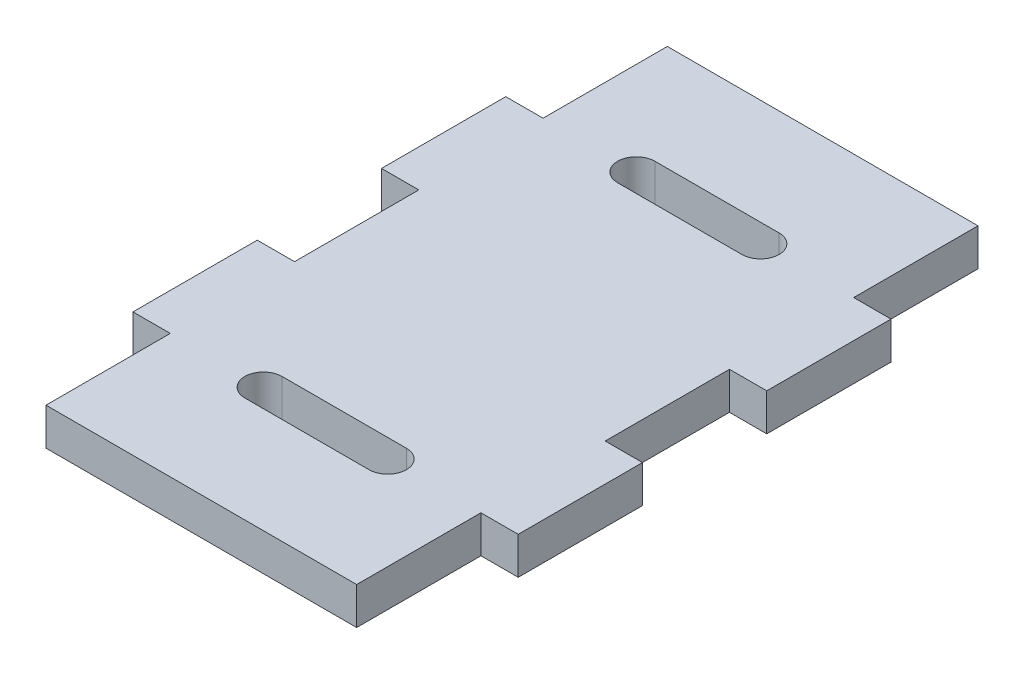
ISO-10303-21;
HEADER;
FILE_DESCRIPTION(('STEP AP214'),'2;1');
FILE_NAME('part.step','',(''),(''),'','','');
FILE_SCHEMA(('AUTOMOTIVE_DESIGN { 1 0 10303 214 1 1 1 1 }'));
ENDSEC;
DATA;
#1=APPLICATION_CONTEXT('core data for automotive mechanical design processes');
#2=APPLICATION_PROTOCOL_DEFINITION('international standard','automotive_design',2000,#1);
#3=PRODUCT_CONTEXT('',#1,'mechanical');
#4=PRODUCT('Part','Part','',(#3));
#5=PRODUCT_RELATED_PRODUCT_CATEGORY('part','',(#4));
#6=PRODUCT_DEFINITION_FORMATION('','',#4);
#7=PRODUCT_DEFINITION_CONTEXT('part definition',#1,'design');
#8=PRODUCT_DEFINITION('design','',#6,#7);
#9=PRODUCT_DEFINITION_SHAPE('','',#8);
#10=(LENGTH_UNIT() NAMED_UNIT(*) SI_UNIT(.MILLI.,.METRE.));
#11=(NAMED_UNIT(*) PLANE_ANGLE_UNIT() SI_UNIT($,.RADIAN.));
#12=(NAMED_UNIT(*) SI_UNIT($,.STERADIAN.) SOLID_ANGLE_UNIT());
#13=UNCERTAINTY_MEASURE_WITH_UNIT(LENGTH_MEASURE(1.E-05),#10,'distance_accuracy_value','');
#14=(GEOMETRIC_REPRESENTATION_CONTEXT(3) GLOBAL_UNCERTAINTY_ASSIGNED_CONTEXT((#13)) GLOBAL_UNIT_ASSIGNED_CONTEXT((#10,
#11,#12)) REPRESENTATION_CONTEXT('',''));
#15=CARTESIAN_POINT('',(0.,0.,0.));
#16=DIRECTION('',(0.,0.,1.));
#17=DIRECTION('',(1.,0.,0.));
#18=AXIS2_PLACEMENT_3D('',#15,#16,#17);
#19=CARTESIAN_POINT('',(-12.5,3.,25.));
#20=DIRECTION('',(1.,0.,0.));
#21=DIRECTION('',(0.,0.,-1.));
#22=AXIS2_PLACEMENT_3D('',#19,#20,#21);
#23=PLANE('',#22);
#24=DIRECTION('',(0.,0.,1.));
#25=VECTOR('',#24,1.);
#26=CARTESIAN_POINT('',(-12.5,0.,25.));
#27=LINE('',#26,#25);
#28=CARTESIAN_POINT('',(-12.5,0.,-25.));
#29=VERTEX_POINT('',#28);
#30=CARTESIAN_POINT('',(-12.5,0.,-15.));
#31=VERTEX_POINT('',#30);
#32=EDGE_CURVE('E280',#29,#31,#27,.T.);
#33=ORIENTED_EDGE('',*,*,#32,.T.);
#34=DIRECTION('',(0.,1.,0.));
#35=VECTOR('',#34,1.);
#36=CARTESIAN_POINT('',(-12.5,-10.4403065089106,-15.));
#37=LINE('',#36,#35);
#38=CARTESIAN_POINT('',(-12.5,3.,-15.));
#39=VERTEX_POINT('',#38);
#40=EDGE_CURVE('E58',#31,#39,#37,.T.);
#41=ORIENTED_EDGE('',*,*,#40,.T.);
#42=DIRECTION('',(0.,0.,1.));
#43=VECTOR('',#42,1.);
#44=CARTESIAN_POINT('',(-12.5,3.,25.));
#45=LINE('',#44,#43);
#46=CARTESIAN_POINT('',(-12.5,3.,-25.));
#47=VERTEX_POINT('',#46);
#48=EDGE_CURVE('E245',#47,#39,#45,.T.);
#49=ORIENTED_EDGE('',*,*,#48,.F.);
#50=DIRECTION('',(0.,-1.,0.));
#51=VECTOR('',#50,1.);
#52=CARTESIAN_POINT('',(-12.5,3.,-25.));
#53=LINE('',#52,#51);
#54=EDGE_CURVE('E321',#47,#29,#53,.T.);
#55=ORIENTED_EDGE('',*,*,#54,.T.);
#56=EDGE_LOOP('',(#33,#41,#49,#55));
#57=FACE_BOUND('',#56,.T.);
#58=ADVANCED_FACE('F33',(#57),#23,.F.);
#59=DIRECTION('',(0.,1.,0.));
#60=VECTOR('',#59,1.);
#61=CARTESIAN_POINT('',(-12.5,-10.4403065089106,15.));
#62=LINE('',#61,#60);
#63=CARTESIAN_POINT('',(-12.5,0.,15.));
#64=VERTEX_POINT('',#63);
#65=CARTESIAN_POINT('',(-12.5,3.,15.));
#66=VERTEX_POINT('',#65);
#67=EDGE_CURVE('E272',#64,#66,#62,.T.);
#68=ORIENTED_EDGE('',*,*,#67,.F.);
#69=CARTESIAN_POINT('',(-12.5,0.,25.));
#70=VERTEX_POINT('',#69);
#71=EDGE_CURVE('E281',#64,#70,#27,.T.);
#72=ORIENTED_EDGE('',*,*,#71,.T.);
#73=DIRECTION('',(0.,-1.,0.));
#74=VECTOR('',#73,1.);
#75=CARTESIAN_POINT('',(-12.5,3.,25.));
#76=LINE('',#75,#74);
#77=CARTESIAN_POINT('',(-12.5,3.,25.));
#78=VERTEX_POINT('',#77);
#79=EDGE_CURVE('E11',#78,#70,#76,.T.);
#80=ORIENTED_EDGE('',*,*,#79,.F.);
#81=EDGE_CURVE('E320',#66,#78,#45,.T.);
#82=ORIENTED_EDGE('',*,*,#81,.F.);
#83=EDGE_LOOP('',(#68,#72,#80,#82));
#84=FACE_BOUND('',#83,.T.);
#85=ADVANCED_FACE('F454',(#84),#23,.F.);
#86=CARTESIAN_POINT('',(12.5,3.,25.));
#87=DIRECTION('',(-1.,0.,0.));
#88=DIRECTION('',(0.,0.,1.));
#89=AXIS2_PLACEMENT_3D('',#86,#87,#88);
#90=PLANE('',#89);
#91=DIRECTION('',(0.,0.,-1.));
#92=VECTOR('',#91,1.);
#93=CARTESIAN_POINT('',(12.5,3.,25.));
#94=LINE('',#93,#92);
#95=CARTESIAN_POINT('',(12.5,3.,5.));
#96=VERTEX_POINT('',#95);
#97=CARTESIAN_POINT('',(12.5,3.,-5.));
#98=VERTEX_POINT('',#97);
#99=EDGE_CURVE('E295',#96,#98,#94,.T.);
#100=ORIENTED_EDGE('',*,*,#99,.F.);
#101=DIRECTION('',(0.,1.,0.));
#102=VECTOR('',#101,1.);
#103=CARTESIAN_POINT('',(12.5,-10.4403065089106,5.));
#104=LINE('',#103,#102);
#105=CARTESIAN_POINT('',(12.5,0.,5.));
#106=VERTEX_POINT('',#105);
#107=EDGE_CURVE('E354',#106,#96,#104,.T.);
#108=ORIENTED_EDGE('',*,*,#107,.F.);
#109=DIRECTION('',(0.,0.,-1.));
#110=VECTOR('',#109,1.);
#111=CARTESIAN_POINT('',(12.5,0.,25.));
#112=LINE('',#111,#110);
#113=CARTESIAN_POINT('',(12.5,0.,-5.));
#114=VERTEX_POINT('',#113);
#115=EDGE_CURVE('E299',#106,#114,#112,.T.);
#116=ORIENTED_EDGE('',*,*,#115,.T.);
#117=DIRECTION('',(0.,1.,0.));
#118=VECTOR('',#117,1.);
#119=CARTESIAN_POINT('',(12.5,-10.4403065089106,-5.));
#120=LINE('',#119,#118);
#121=EDGE_CURVE('E351',#114,#98,#120,.T.);
#122=ORIENTED_EDGE('',*,*,#121,.T.);
#123=EDGE_LOOP('',(#100,#108,#116,#122));
#124=FACE_BOUND('',#123,.T.);
#125=ADVANCED_FACE('F349',(#124),#90,.F.);
#126=DIRECTION('',(0.,1.,0.));
#127=VECTOR('',#126,1.);
#128=CARTESIAN_POINT('',(12.5,-10.4403065089106,-15.));
#129=LINE('',#128,#127);
#130=CARTESIAN_POINT('',(12.5,0.,-15.));
#131=VERTEX_POINT('',#130);
#132=CARTESIAN_POINT('',(12.5,3.,-15.));
#133=VERTEX_POINT('',#132);
#134=EDGE_CURVE('E498',#131,#133,#129,.T.);
#135=ORIENTED_EDGE('',*,*,#134,.F.);
#136=CARTESIAN_POINT('',(12.5,0.,-25.));
#137=VERTEX_POINT('',#136);
#138=EDGE_CURVE('E311',#131,#137,#112,.T.);
#139=ORIENTED_EDGE('',*,*,#138,.T.);
#140=DIRECTION('',(0.,-1.,0.));
#141=VECTOR('',#140,1.);
#142=CARTESIAN_POINT('',(12.5,3.,-25.));
#143=LINE('',#142,#141);
#144=CARTESIAN_POINT('',(12.5,3.,-25.));
#145=VERTEX_POINT('',#144);
#146=EDGE_CURVE('E324',#145,#137,#143,.T.);
#147=ORIENTED_EDGE('',*,*,#146,.F.);
#148=EDGE_CURVE('E298',#133,#145,#94,.T.);
#149=ORIENTED_EDGE('',*,*,#148,.F.);
#150=EDGE_LOOP('',(#135,#139,#147,#149));
#151=FACE_BOUND('',#150,.T.);
#152=ADVANCED_FACE('F556',(#151),#90,.F.);
#153=CARTESIAN_POINT('',(0.,3.,0.));
#154=DIRECTION('',(0.,1.,0.));
#155=DIRECTION('',(0.,0.,1.));
#156=AXIS2_PLACEMENT_3D('',#153,#154,#155);
#157=PLANE('',#156);
#158=ORIENTED_EDGE('',*,*,#48,.T.);
#159=DIRECTION('',(-1.,0.,0.));
#160=VECTOR('',#159,1.);
#161=CARTESIAN_POINT('',(-12.5,3.,-15.));
#162=LINE('',#161,#160);
#163=CARTESIAN_POINT('',(-15.5,3.,-15.));
#164=VERTEX_POINT('',#163);
#165=EDGE_CURVE('E227',#39,#164,#162,.T.);
#166=ORIENTED_EDGE('',*,*,#165,.T.);
#167=DIRECTION('',(0.,0.,1.));
#168=VECTOR('',#167,1.);
#169=CARTESIAN_POINT('',(-15.5,3.,-15.));
#170=LINE('',#169,#168);
#171=CARTESIAN_POINT('',(-15.5,3.,-5.));
#172=VERTEX_POINT('',#171);
#173=EDGE_CURVE('E236',#164,#172,#170,.T.);
#174=ORIENTED_EDGE('',*,*,#173,.T.);
#175=DIRECTION('',(1.,0.,0.));
#176=VECTOR('',#175,1.);
#177=CARTESIAN_POINT('',(-12.5,3.,-5.));
#178=LINE('',#177,#176);
#179=CARTESIAN_POINT('',(-12.5,3.,-5.));
#180=VERTEX_POINT('',#179);
#181=EDGE_CURVE('E233',#172,#180,#178,.T.);
#182=ORIENTED_EDGE('',*,*,#181,.T.);
#183=CARTESIAN_POINT('',(-12.5,3.,5.));
#184=VERTEX_POINT('',#183);
#185=EDGE_CURVE('E37',#180,#184,#45,.T.);
#186=ORIENTED_EDGE('',*,*,#185,.T.);
#187=DIRECTION('',(-1.,0.,0.));
#188=VECTOR('',#187,1.);
#189=CARTESIAN_POINT('',(-12.5,3.,5.));
#190=LINE('',#189,#188);
#191=CARTESIAN_POINT('',(-15.5,3.,5.));
#192=VERTEX_POINT('',#191);
#193=EDGE_CURVE('E258',#184,#192,#190,.T.);
#194=ORIENTED_EDGE('',*,*,#193,.T.);
#195=DIRECTION('',(0.,0.,1.));
#196=VECTOR('',#195,1.);
#197=CARTESIAN_POINT('',(-15.5,3.,5.));
#198=LINE('',#197,#196);
#199=CARTESIAN_POINT('',(-15.5,3.,15.));
#200=VERTEX_POINT('',#199);
#201=EDGE_CURVE('E259',#192,#200,#198,.T.);
#202=ORIENTED_EDGE('',*,*,#201,.T.);
#203=DIRECTION('',(1.,0.,0.));
#204=VECTOR('',#203,1.);
#205=CARTESIAN_POINT('',(-12.5,3.,15.));
#206=LINE('',#205,#204);
#207=EDGE_CURVE('E262',#200,#66,#206,.T.);
#208=ORIENTED_EDGE('',*,*,#207,.T.);
#209=ORIENTED_EDGE('',*,*,#81,.T.);
#210=DIRECTION('',(1.,0.,0.));
#211=VECTOR('',#210,1.);
#212=CARTESIAN_POINT('',(12.5,3.,25.));
#213=LINE('',#212,#211);
#214=CARTESIAN_POINT('',(12.5,3.,25.));
#215=VERTEX_POINT('',#214);
#216=EDGE_CURVE('E303',#78,#215,#213,.T.);
#217=ORIENTED_EDGE('',*,*,#216,.T.);
#218=CARTESIAN_POINT('',(12.5,3.,15.));
#219=VERTEX_POINT('',#218);
#220=EDGE_CURVE('E297',#215,#219,#94,.T.);
#221=ORIENTED_EDGE('',*,*,#220,.T.);
#222=DIRECTION('',(1.,0.,0.));
#223=VECTOR('',#222,1.);
#224=CARTESIAN_POINT('',(12.5,3.,15.));
#225=LINE('',#224,#223);
#226=CARTESIAN_POINT('',(15.5,3.,15.));
#227=VERTEX_POINT('',#226);
#228=EDGE_CURVE('E476',#219,#227,#225,.T.);
#229=ORIENTED_EDGE('',*,*,#228,.T.);
#230=DIRECTION('',(0.,0.,-1.));
#231=VECTOR('',#230,1.);
#232=CARTESIAN_POINT('',(15.5,3.,5.));
#233=LINE('',#232,#231);
#234=CARTESIAN_POINT('',(15.5,3.,5.));
#235=VERTEX_POINT('',#234);
#236=EDGE_CURVE('E483',#227,#235,#233,.T.);
#237=ORIENTED_EDGE('',*,*,#236,.T.);
#238=DIRECTION('',(-1.,0.,0.));
#239=VECTOR('',#238,1.);
#240=CARTESIAN_POINT('',(12.5,3.,5.));
#241=LINE('',#240,#239);
#242=EDGE_CURVE('E486',#235,#96,#241,.T.);
#243=ORIENTED_EDGE('',*,*,#242,.T.);
#244=ORIENTED_EDGE('',*,*,#99,.T.);
#245=DIRECTION('',(1.,0.,0.));
#246=VECTOR('',#245,1.);
#247=CARTESIAN_POINT('',(12.5,3.,-5.));
#248=LINE('',#247,#246);
#249=CARTESIAN_POINT('',(15.5,3.,-5.));
#250=VERTEX_POINT('',#249);
#251=EDGE_CURVE('E367',#98,#250,#248,.T.);
#252=ORIENTED_EDGE('',*,*,#251,.T.);
#253=DIRECTION('',(0.,0.,-1.));
#254=VECTOR('',#253,1.);
#255=CARTESIAN_POINT('',(15.5,3.,-15.));
#256=LINE('',#255,#254);
#257=CARTESIAN_POINT('',(15.5,3.,-15.));
#258=VERTEX_POINT('',#257);
#259=EDGE_CURVE('E374',#250,#258,#256,.T.);
#260=ORIENTED_EDGE('',*,*,#259,.T.);
#261=DIRECTION('',(-1.,0.,0.));
#262=VECTOR('',#261,1.);
#263=CARTESIAN_POINT('',(12.5,3.,-15.));
#264=LINE('',#263,#262);
#265=EDGE_CURVE('E369',#258,#133,#264,.T.);
#266=ORIENTED_EDGE('',*,*,#265,.T.);
#267=ORIENTED_EDGE('',*,*,#148,.T.);
#268=DIRECTION('',(-1.,0.,0.));
#269=VECTOR('',#268,1.);
#270=CARTESIAN_POINT('',(12.5,3.,-25.));
#271=LINE('',#270,#269);
#272=EDGE_CURVE('E285',#145,#47,#271,.T.);
#273=ORIENTED_EDGE('',*,*,#272,.T.);
#274=EDGE_LOOP('',(#158,#166,#174,#182,#186,#194,#202,#208,#209,#217,#221,#229,#237,#243,#244,
#252,#260,#266,#267,#273));
#275=FACE_BOUND('',#274,.T.);
#276=DIRECTION('',(1.,0.,0.));
#277=VECTOR('',#276,1.);
#278=CARTESIAN_POINT('',(-5.,3.,-13.5));
#279=LINE('',#278,#277);
#280=CARTESIAN_POINT('',(-5.,3.,-13.5));
#281=VERTEX_POINT('',#280);
#282=CARTESIAN_POINT('',(5.,3.,-13.5));
#283=VERTEX_POINT('',#282);
#284=EDGE_CURVE('E416',#281,#283,#279,.T.);
#285=ORIENTED_EDGE('',*,*,#284,.F.);
#286=CARTESIAN_POINT('',(-5.,3.,-15.));
#287=DIRECTION('',(0.,1.,0.));
#288=DIRECTION('',(0.,0.,1.));
#289=AXIS2_PLACEMENT_3D('',#286,#287,#288);
#290=CIRCLE('',#289,1.5);
#291=CARTESIAN_POINT('',(-5.,3.,-16.5));
#292=VERTEX_POINT('',#291);
#293=EDGE_CURVE('E414',#292,#281,#290,.T.);
#294=ORIENTED_EDGE('',*,*,#293,.F.);
#295=DIRECTION('',(-1.,0.,0.));
#296=VECTOR('',#295,1.);
#297=CARTESIAN_POINT('',(-5.,3.,-16.5));
#298=LINE('',#297,#296);
#299=CARTESIAN_POINT('',(5.,3.,-16.5));
#300=VERTEX_POINT('',#299);
#301=EDGE_CURVE('E422',#300,#292,#298,.T.);
#302=ORIENTED_EDGE('',*,*,#301,.F.);
#303=CARTESIAN_POINT('',(5.,3.,-15.));
#304=DIRECTION('',(0.,1.,0.));
#305=DIRECTION('',(0.,0.,1.));
#306=AXIS2_PLACEMENT_3D('',#303,#304,#305);
#307=CIRCLE('',#306,1.5);
#308=EDGE_CURVE('E419',#283,#300,#307,.T.);
#309=ORIENTED_EDGE('',*,*,#308,.F.);
#310=EDGE_LOOP('',(#285,#294,#302,#309));
#311=FACE_BOUND('',#310,.T.);
#312=DIRECTION('',(1.,0.,0.));
#313=VECTOR('',#312,1.);
#314=CARTESIAN_POINT('',(-4.99999999999999,3.,16.5));
#315=LINE('',#314,#313);
#316=CARTESIAN_POINT('',(-4.99999999999999,3.,16.5));
#317=VERTEX_POINT('',#316);
#318=CARTESIAN_POINT('',(5.00000000000001,3.,16.5));
#319=VERTEX_POINT('',#318);
#320=EDGE_CURVE('E385',#317,#319,#315,.T.);
#321=ORIENTED_EDGE('',*,*,#320,.F.);
#322=CARTESIAN_POINT('',(-4.99999999999999,3.,15.));
#323=DIRECTION('',(0.,1.,0.));
#324=DIRECTION('',(0.,0.,-1.));
#325=AXIS2_PLACEMENT_3D('',#322,#323,#324);
#326=CIRCLE('',#325,1.5);
#327=CARTESIAN_POINT('',(-4.99999999999999,3.,13.5));
#328=VERTEX_POINT('',#327);
#329=EDGE_CURVE('E383',#328,#317,#326,.T.);
#330=ORIENTED_EDGE('',*,*,#329,.F.);
#331=DIRECTION('',(-1.,0.,0.));
#332=VECTOR('',#331,1.);
#333=CARTESIAN_POINT('',(-4.99999999999999,3.,13.5));
#334=LINE('',#333,#332);
#335=CARTESIAN_POINT('',(5.00000000000001,3.,13.5));
#336=VERTEX_POINT('',#335);
#337=EDGE_CURVE('E391',#336,#328,#334,.T.);
#338=ORIENTED_EDGE('',*,*,#337,.F.);
#339=CARTESIAN_POINT('',(5.00000000000001,3.,15.));
#340=DIRECTION('',(0.,1.,0.));
#341=DIRECTION('',(0.,0.,-1.));
#342=AXIS2_PLACEMENT_3D('',#339,#340,#341);
#343=CIRCLE('',#342,1.5);
#344=EDGE_CURVE('E388',#319,#336,#343,.T.);
#345=ORIENTED_EDGE('',*,*,#344,.F.);
#346=EDGE_LOOP('',(#321,#330,#338,#345));
#347=FACE_BOUND('',#346,.T.);
#348=ADVANCED_FACE('F243',(#275,#311,#347),#157,.T.);
#349=CARTESIAN_POINT('',(0.,0.,0.));
#350=DIRECTION('',(0.,1.,0.));
#351=DIRECTION('',(0.,0.,1.));
#352=AXIS2_PLACEMENT_3D('',#349,#350,#351);
#353=PLANE('',#352);
#354=CARTESIAN_POINT('',(-5.,0.,-15.));
#355=DIRECTION('',(0.,1.,0.));
#356=DIRECTION('',(0.,0.,1.));
#357=AXIS2_PLACEMENT_3D('',#354,#355,#356);
#358=CIRCLE('',#357,1.5);
#359=CARTESIAN_POINT('',(-5.,0.,-16.5));
#360=VERTEX_POINT('',#359);
#361=CARTESIAN_POINT('',(-5.,0.,-13.5));
#362=VERTEX_POINT('',#361);
#363=EDGE_CURVE('E413',#360,#362,#358,.T.);
#364=ORIENTED_EDGE('',*,*,#363,.T.);
#365=DIRECTION('',(1.,0.,0.));
#366=VECTOR('',#365,1.);
#367=CARTESIAN_POINT('',(-5.,0.,-13.5));
#368=LINE('',#367,#366);
#369=CARTESIAN_POINT('',(5.,0.,-13.5));
#370=VERTEX_POINT('',#369);
#371=EDGE_CURVE('E427',#362,#370,#368,.T.);
#372=ORIENTED_EDGE('',*,*,#371,.T.);
#373=CARTESIAN_POINT('',(5.,0.,-15.));
#374=DIRECTION('',(0.,1.,0.));
#375=DIRECTION('',(0.,0.,1.));
#376=AXIS2_PLACEMENT_3D('',#373,#374,#375);
#377=CIRCLE('',#376,1.5);
#378=CARTESIAN_POINT('',(5.,0.,-16.5));
#379=VERTEX_POINT('',#378);
#380=EDGE_CURVE('E430',#370,#379,#377,.T.);
#381=ORIENTED_EDGE('',*,*,#380,.T.);
#382=DIRECTION('',(-1.,0.,0.));
#383=VECTOR('',#382,1.);
#384=CARTESIAN_POINT('',(-5.,0.,-16.5));
#385=LINE('',#384,#383);
#386=EDGE_CURVE('E417',#379,#360,#385,.T.);
#387=ORIENTED_EDGE('',*,*,#386,.T.);
#388=EDGE_LOOP('',(#364,#372,#381,#387));
#389=FACE_BOUND('',#388,.T.);
#390=ORIENTED_EDGE('',*,*,#32,.F.);
#391=DIRECTION('',(-1.,0.,0.));
#392=VECTOR('',#391,1.);
#393=CARTESIAN_POINT('',(12.5,0.,-25.));
#394=LINE('',#393,#392);
#395=EDGE_CURVE('E316',#137,#29,#394,.T.);
#396=ORIENTED_EDGE('',*,*,#395,.F.);
#397=ORIENTED_EDGE('',*,*,#138,.F.);
#398=DIRECTION('',(1.,0.,0.));
#399=VECTOR('',#398,1.);
#400=CARTESIAN_POINT('',(12.5,0.,-15.));
#401=LINE('',#400,#399);
#402=CARTESIAN_POINT('',(15.5,0.,-15.));
#403=VERTEX_POINT('',#402);
#404=EDGE_CURVE('E363',#131,#403,#401,.T.);
#405=ORIENTED_EDGE('',*,*,#404,.T.);
#406=DIRECTION('',(0.,0.,1.));
#407=VECTOR('',#406,1.);
#408=CARTESIAN_POINT('',(15.5,0.,-15.));
#409=LINE('',#408,#407);
#410=CARTESIAN_POINT('',(15.5,0.,-5.));
#411=VERTEX_POINT('',#410);
#412=EDGE_CURVE('E359',#403,#411,#409,.T.);
#413=ORIENTED_EDGE('',*,*,#412,.T.);
#414=DIRECTION('',(-1.,0.,0.));
#415=VECTOR('',#414,1.);
#416=CARTESIAN_POINT('',(12.5,0.,-5.));
#417=LINE('',#416,#415);
#418=EDGE_CURVE('E357',#411,#114,#417,.T.);
#419=ORIENTED_EDGE('',*,*,#418,.T.);
#420=ORIENTED_EDGE('',*,*,#115,.F.);
#421=DIRECTION('',(1.,0.,0.));
#422=VECTOR('',#421,1.);
#423=CARTESIAN_POINT('',(12.5,0.,5.));
#424=LINE('',#423,#422);
#425=CARTESIAN_POINT('',(15.5,0.,5.));
#426=VERTEX_POINT('',#425);
#427=EDGE_CURVE('E479',#106,#426,#424,.T.);
#428=ORIENTED_EDGE('',*,*,#427,.T.);
#429=DIRECTION('',(0.,0.,1.));
#430=VECTOR('',#429,1.);
#431=CARTESIAN_POINT('',(15.5,0.,5.));
#432=LINE('',#431,#430);
#433=CARTESIAN_POINT('',(15.5,0.,15.));
#434=VERTEX_POINT('',#433);
#435=EDGE_CURVE('E477',#426,#434,#432,.T.);
#436=ORIENTED_EDGE('',*,*,#435,.T.);
#437=DIRECTION('',(-1.,0.,0.));
#438=VECTOR('',#437,1.);
#439=CARTESIAN_POINT('',(12.5,0.,15.));
#440=LINE('',#439,#438);
#441=CARTESIAN_POINT('',(12.5,0.,15.));
#442=VERTEX_POINT('',#441);
#443=EDGE_CURVE('E343',#434,#442,#440,.T.);
#444=ORIENTED_EDGE('',*,*,#443,.T.);
#445=CARTESIAN_POINT('',(12.5,0.,25.));
#446=VERTEX_POINT('',#445);
#447=EDGE_CURVE('E313',#446,#442,#112,.T.);
#448=ORIENTED_EDGE('',*,*,#447,.F.);
#449=DIRECTION('',(1.,0.,0.));
#450=VECTOR('',#449,1.);
#451=CARTESIAN_POINT('',(12.5,0.,25.));
#452=LINE('',#451,#450);
#453=EDGE_CURVE('E287',#70,#446,#452,.T.);
#454=ORIENTED_EDGE('',*,*,#453,.F.);
#455=ORIENTED_EDGE('',*,*,#71,.F.);
#456=DIRECTION('',(-1.,0.,0.));
#457=VECTOR('',#456,1.);
#458=CARTESIAN_POINT('',(-12.5,0.,15.));
#459=LINE('',#458,#457);
#460=CARTESIAN_POINT('',(-15.5,0.,15.));
#461=VERTEX_POINT('',#460);
#462=EDGE_CURVE('E271',#64,#461,#459,.T.);
#463=ORIENTED_EDGE('',*,*,#462,.T.);
#464=DIRECTION('',(0.,0.,-1.));
#465=VECTOR('',#464,1.);
#466=CARTESIAN_POINT('',(-15.5,0.,5.));
#467=LINE('',#466,#465);
#468=CARTESIAN_POINT('',(-15.5,0.,5.));
#469=VERTEX_POINT('',#468);
#470=EDGE_CURVE('E464',#461,#469,#467,.T.);
#471=ORIENTED_EDGE('',*,*,#470,.T.);
#472=DIRECTION('',(1.,0.,0.));
#473=VECTOR('',#472,1.);
#474=CARTESIAN_POINT('',(-12.5,0.,5.));
#475=LINE('',#474,#473);
#476=CARTESIAN_POINT('',(-12.5,0.,5.));
#477=VERTEX_POINT('',#476);
#478=EDGE_CURVE('E461',#469,#477,#475,.T.);
#479=ORIENTED_EDGE('',*,*,#478,.T.);
#480=CARTESIAN_POINT('',(-12.5,0.,-5.));
#481=VERTEX_POINT('',#480);
#482=EDGE_CURVE('E278',#481,#477,#27,.T.);
#483=ORIENTED_EDGE('',*,*,#482,.F.);
#484=DIRECTION('',(-1.,0.,0.));
#485=VECTOR('',#484,1.);
#486=CARTESIAN_POINT('',(-12.5,0.,-5.));
#487=LINE('',#486,#485);
#488=CARTESIAN_POINT('',(-15.5,0.,-5.));
#489=VERTEX_POINT('',#488);
#490=EDGE_CURVE('E252',#481,#489,#487,.T.);
#491=ORIENTED_EDGE('',*,*,#490,.T.);
#492=DIRECTION('',(0.,0.,-1.));
#493=VECTOR('',#492,1.);
#494=CARTESIAN_POINT('',(-15.5,0.,-15.));
#495=LINE('',#494,#493);
#496=CARTESIAN_POINT('',(-15.5,0.,-15.));
#497=VERTEX_POINT('',#496);
#498=EDGE_CURVE('E256',#489,#497,#495,.T.);
#499=ORIENTED_EDGE('',*,*,#498,.T.);
#500=DIRECTION('',(1.,0.,0.));
#501=VECTOR('',#500,1.);
#502=CARTESIAN_POINT('',(-12.5,0.,-15.));
#503=LINE('',#502,#501);
#504=EDGE_CURVE('E229',#497,#31,#503,.T.);
#505=ORIENTED_EDGE('',*,*,#504,.T.);
#506=EDGE_LOOP('',(#390,#396,#397,#405,#413,#419,#420,#428,#436,#444,#448,#454,#455,#463,#471,
#479,#483,#491,#499,#505));
#507=FACE_BOUND('',#506,.T.);
#508=CARTESIAN_POINT('',(-4.99999999999999,0.,15.));
#509=DIRECTION('',(0.,1.,0.));
#510=DIRECTION('',(0.,0.,-1.));
#511=AXIS2_PLACEMENT_3D('',#508,#509,#510);
#512=CIRCLE('',#511,1.5);
#513=CARTESIAN_POINT('',(-4.99999999999999,0.,13.5));
#514=VERTEX_POINT('',#513);
#515=CARTESIAN_POINT('',(-4.99999999999999,0.,16.5));
#516=VERTEX_POINT('',#515);
#517=EDGE_CURVE('E362',#514,#516,#512,.T.);
#518=ORIENTED_EDGE('',*,*,#517,.T.);
#519=DIRECTION('',(1.,0.,0.));
#520=VECTOR('',#519,1.);
#521=CARTESIAN_POINT('',(-4.99999999999999,0.,16.5));
#522=LINE('',#521,#520);
#523=CARTESIAN_POINT('',(5.00000000000001,0.,16.5));
#524=VERTEX_POINT('',#523);
#525=EDGE_CURVE('E396',#516,#524,#522,.T.);
#526=ORIENTED_EDGE('',*,*,#525,.T.);
#527=CARTESIAN_POINT('',(5.00000000000001,0.,15.));
#528=DIRECTION('',(0.,1.,0.));
#529=DIRECTION('',(0.,0.,-1.));
#530=AXIS2_PLACEMENT_3D('',#527,#528,#529);
#531=CIRCLE('',#530,1.5);
#532=CARTESIAN_POINT('',(5.00000000000001,0.,13.5));
#533=VERTEX_POINT('',#532);
#534=EDGE_CURVE('E399',#524,#533,#531,.T.);
#535=ORIENTED_EDGE('',*,*,#534,.T.);
#536=DIRECTION('',(-1.,0.,0.));
#537=VECTOR('',#536,1.);
#538=CARTESIAN_POINT('',(-4.99999999999999,0.,13.5));
#539=LINE('',#538,#537);
#540=EDGE_CURVE('E386',#533,#514,#539,.T.);
#541=ORIENTED_EDGE('',*,*,#540,.T.);
#542=EDGE_LOOP('',(#518,#526,#535,#541));
#543=FACE_BOUND('',#542,.T.);
#544=ADVANCED_FACE('F339',(#389,#507,#543),#353,.F.);
#545=ORIENTED_EDGE('',*,*,#185,.F.);
#546=DIRECTION('',(0.,1.,0.));
#547=VECTOR('',#546,1.);
#548=CARTESIAN_POINT('',(-12.5,-10.4403065089106,-5.));
#549=LINE('',#548,#547);
#550=EDGE_CURVE('E253',#481,#180,#549,.T.);
#551=ORIENTED_EDGE('',*,*,#550,.F.);
#552=ORIENTED_EDGE('',*,*,#482,.T.);
#553=DIRECTION('',(0.,1.,0.));
#554=VECTOR('',#553,1.);
#555=CARTESIAN_POINT('',(-12.5,-10.4403065089106,5.));
#556=LINE('',#555,#554);
#557=EDGE_CURVE('E268',#477,#184,#556,.T.);
#558=ORIENTED_EDGE('',*,*,#557,.T.);
#559=EDGE_LOOP('',(#545,#551,#552,#558));
#560=FACE_BOUND('',#559,.T.);
#561=ADVANCED_FACE('F35',(#560),#23,.F.);
#562=CARTESIAN_POINT('',(12.5,3.,25.));
#563=DIRECTION('',(0.,0.,-1.));
#564=DIRECTION('',(-1.,0.,0.));
#565=AXIS2_PLACEMENT_3D('',#562,#563,#564);
#566=PLANE('',#565);
#567=ORIENTED_EDGE('',*,*,#453,.T.);
#568=DIRECTION('',(0.,-1.,0.));
#569=VECTOR('',#568,1.);
#570=CARTESIAN_POINT('',(12.5,3.,25.));
#571=LINE('',#570,#569);
#572=EDGE_CURVE('E43',#215,#446,#571,.T.);
#573=ORIENTED_EDGE('',*,*,#572,.F.);
#574=ORIENTED_EDGE('',*,*,#216,.F.);
#575=ORIENTED_EDGE('',*,*,#79,.T.);
#576=EDGE_LOOP('',(#567,#573,#574,#575));
#577=FACE_BOUND('',#576,.T.);
#578=ADVANCED_FACE('F453',(#577),#566,.F.);
#579=ORIENTED_EDGE('',*,*,#447,.T.);
#580=DIRECTION('',(0.,1.,0.));
#581=VECTOR('',#580,1.);
#582=CARTESIAN_POINT('',(12.5,-10.4403065089106,15.));
#583=LINE('',#582,#581);
#584=EDGE_CURVE('E489',#442,#219,#583,.T.);
#585=ORIENTED_EDGE('',*,*,#584,.T.);
#586=ORIENTED_EDGE('',*,*,#220,.F.);
#587=ORIENTED_EDGE('',*,*,#572,.T.);
#588=EDGE_LOOP('',(#579,#585,#586,#587));
#589=FACE_BOUND('',#588,.T.);
#590=ADVANCED_FACE('F332',(#589),#90,.F.);
#591=CARTESIAN_POINT('',(12.5,3.,-25.));
#592=DIRECTION('',(0.,0.,1.));
#593=DIRECTION('',(1.,0.,0.));
#594=AXIS2_PLACEMENT_3D('',#591,#592,#593);
#595=PLANE('',#594);
#596=ORIENTED_EDGE('',*,*,#395,.T.);
#597=ORIENTED_EDGE('',*,*,#54,.F.);
#598=ORIENTED_EDGE('',*,*,#272,.F.);
#599=ORIENTED_EDGE('',*,*,#146,.T.);
#600=EDGE_LOOP('',(#596,#597,#598,#599));
#601=FACE_BOUND('',#600,.T.);
#602=ADVANCED_FACE('F560',(#601),#595,.F.);
#603=CARTESIAN_POINT('',(-5.,3.,-15.));
#604=DIRECTION('',(0.,-1.,0.));
#605=DIRECTION('',(0.,0.,-1.));
#606=AXIS2_PLACEMENT_3D('',#603,#604,#605);
#607=CYLINDRICAL_SURFACE('',#606,1.5);
#608=ORIENTED_EDGE('',*,*,#363,.F.);
#609=DIRECTION('',(0.,-1.,0.));
#610=VECTOR('',#609,1.);
#611=CARTESIAN_POINT('',(-5.,3.,-16.5));
#612=LINE('',#611,#610);
#613=EDGE_CURVE('E424',#292,#360,#612,.T.);
#614=ORIENTED_EDGE('',*,*,#613,.F.);
#615=ORIENTED_EDGE('',*,*,#293,.T.);
#616=DIRECTION('',(0.,-1.,0.));
#617=VECTOR('',#616,1.);
#618=CARTESIAN_POINT('',(-5.,3.,-13.5));
#619=LINE('',#618,#617);
#620=EDGE_CURVE('E441',#281,#362,#619,.T.);
#621=ORIENTED_EDGE('',*,*,#620,.T.);
#622=EDGE_LOOP('',(#608,#614,#615,#621));
#623=FACE_BOUND('',#622,.T.);
#624=ADVANCED_FACE('F563',(#623),#607,.F.);
#625=CARTESIAN_POINT('',(-5.,3.,-13.5));
#626=DIRECTION('',(0.,0.,-1.));
#627=DIRECTION('',(-1.,0.,0.));
#628=AXIS2_PLACEMENT_3D('',#625,#626,#627);
#629=PLANE('',#628);
#630=ORIENTED_EDGE('',*,*,#371,.F.);
#631=ORIENTED_EDGE('',*,*,#620,.F.);
#632=ORIENTED_EDGE('',*,*,#284,.T.);
#633=DIRECTION('',(0.,-1.,0.));
#634=VECTOR('',#633,1.);
#635=CARTESIAN_POINT('',(5.,3.,-13.5));
#636=LINE('',#635,#634);
#637=EDGE_CURVE('E439',#283,#370,#636,.T.);
#638=ORIENTED_EDGE('',*,*,#637,.T.);
#639=EDGE_LOOP('',(#630,#631,#632,#638));
#640=FACE_BOUND('',#639,.T.);
#641=ADVANCED_FACE('F625',(#640),#629,.T.);
#642=CARTESIAN_POINT('',(5.,3.,-15.));
#643=DIRECTION('',(0.,-1.,0.));
#644=DIRECTION('',(0.,0.,-1.));
#645=AXIS2_PLACEMENT_3D('',#642,#643,#644);
#646=CYLINDRICAL_SURFACE('',#645,1.5);
#647=ORIENTED_EDGE('',*,*,#380,.F.);
#648=ORIENTED_EDGE('',*,*,#637,.F.);
#649=ORIENTED_EDGE('',*,*,#308,.T.);
#650=DIRECTION('',(0.,-1.,0.));
#651=VECTOR('',#650,1.);
#652=CARTESIAN_POINT('',(5.,3.,-16.5));
#653=LINE('',#652,#651);
#654=EDGE_CURVE('E437',#300,#379,#653,.T.);
#655=ORIENTED_EDGE('',*,*,#654,.T.);
#656=EDGE_LOOP('',(#647,#648,#649,#655));
#657=FACE_BOUND('',#656,.T.);
#658=ADVANCED_FACE('F621',(#657),#646,.F.);
#659=CARTESIAN_POINT('',(-5.,3.,-16.5));
#660=DIRECTION('',(0.,0.,1.));
#661=DIRECTION('',(1.,0.,0.));
#662=AXIS2_PLACEMENT_3D('',#659,#660,#661);
#663=PLANE('',#662);
#664=ORIENTED_EDGE('',*,*,#386,.F.);
#665=ORIENTED_EDGE('',*,*,#654,.F.);
#666=ORIENTED_EDGE('',*,*,#301,.T.);
#667=ORIENTED_EDGE('',*,*,#613,.T.);
#668=EDGE_LOOP('',(#664,#665,#666,#667));
#669=FACE_BOUND('',#668,.T.);
#670=ADVANCED_FACE('F617',(#669),#663,.T.);
#671=CARTESIAN_POINT('',(-4.99999999999999,3.,15.));
#672=DIRECTION('',(0.,-1.,0.));
#673=DIRECTION('',(0.,0.,-1.));
#674=AXIS2_PLACEMENT_3D('',#671,#672,#673);
#675=CYLINDRICAL_SURFACE('',#674,1.5);
#676=ORIENTED_EDGE('',*,*,#517,.F.);
#677=DIRECTION('',(0.,-1.,0.));
#678=VECTOR('',#677,1.);
#679=CARTESIAN_POINT('',(-4.99999999999999,3.,13.5));
#680=LINE('',#679,#678);
#681=EDGE_CURVE('E393',#328,#514,#680,.T.);
#682=ORIENTED_EDGE('',*,*,#681,.F.);
#683=ORIENTED_EDGE('',*,*,#329,.T.);
#684=DIRECTION('',(0.,-1.,0.));
#685=VECTOR('',#684,1.);
#686=CARTESIAN_POINT('',(-4.99999999999999,3.,16.5));
#687=LINE('',#686,#685);
#688=EDGE_CURVE('E410',#317,#516,#687,.T.);
#689=ORIENTED_EDGE('',*,*,#688,.T.);
#690=EDGE_LOOP('',(#676,#682,#683,#689));
#691=FACE_BOUND('',#690,.T.);
#692=ADVANCED_FACE('F613',(#691),#675,.F.);
#693=CARTESIAN_POINT('',(-4.99999999999999,3.,16.5));
#694=DIRECTION('',(0.,0.,-1.));
#695=DIRECTION('',(-1.,0.,0.));
#696=AXIS2_PLACEMENT_3D('',#693,#694,#695);
#697=PLANE('',#696);
#698=ORIENTED_EDGE('',*,*,#525,.F.);
#699=ORIENTED_EDGE('',*,*,#688,.F.);
#700=ORIENTED_EDGE('',*,*,#320,.T.);
#701=DIRECTION('',(0.,-1.,0.));
#702=VECTOR('',#701,1.);
#703=CARTESIAN_POINT('',(5.00000000000001,3.,16.5));
#704=LINE('',#703,#702);
#705=EDGE_CURVE('E408',#319,#524,#704,.T.);
#706=ORIENTED_EDGE('',*,*,#705,.T.);
#707=EDGE_LOOP('',(#698,#699,#700,#706));
#708=FACE_BOUND('',#707,.T.);
#709=ADVANCED_FACE('F609',(#708),#697,.T.);
#710=CARTESIAN_POINT('',(5.00000000000001,3.,15.));
#711=DIRECTION('',(0.,-1.,0.));
#712=DIRECTION('',(0.,0.,-1.));
#713=AXIS2_PLACEMENT_3D('',#710,#711,#712);
#714=CYLINDRICAL_SURFACE('',#713,1.5);
#715=ORIENTED_EDGE('',*,*,#534,.F.);
#716=ORIENTED_EDGE('',*,*,#705,.F.);
#717=ORIENTED_EDGE('',*,*,#344,.T.);
#718=DIRECTION('',(0.,-1.,0.));
#719=VECTOR('',#718,1.);
#720=CARTESIAN_POINT('',(5.00000000000001,3.,13.5));
#721=LINE('',#720,#719);
#722=EDGE_CURVE('E406',#336,#533,#721,.T.);
#723=ORIENTED_EDGE('',*,*,#722,.T.);
#724=EDGE_LOOP('',(#715,#716,#717,#723));
#725=FACE_BOUND('',#724,.T.);
#726=ADVANCED_FACE('F605',(#725),#714,.F.);
#727=CARTESIAN_POINT('',(-4.99999999999999,3.,13.5));
#728=DIRECTION('',(0.,0.,1.));
#729=DIRECTION('',(1.,0.,0.));
#730=AXIS2_PLACEMENT_3D('',#727,#728,#729);
#731=PLANE('',#730);
#732=ORIENTED_EDGE('',*,*,#540,.F.);
#733=ORIENTED_EDGE('',*,*,#722,.F.);
#734=ORIENTED_EDGE('',*,*,#337,.T.);
#735=ORIENTED_EDGE('',*,*,#681,.T.);
#736=EDGE_LOOP('',(#732,#733,#734,#735));
#737=FACE_BOUND('',#736,.T.);
#738=ADVANCED_FACE('F602',(#737),#731,.T.);
#739=CARTESIAN_POINT('',(12.5,-10.4403065089106,-15.));
#740=DIRECTION('',(0.,0.,-1.));
#741=DIRECTION('',(-1.,0.,0.));
#742=AXIS2_PLACEMENT_3D('',#739,#740,#741);
#743=PLANE('',#742);
#744=ORIENTED_EDGE('',*,*,#404,.F.);
#745=ORIENTED_EDGE('',*,*,#134,.T.);
#746=ORIENTED_EDGE('',*,*,#265,.F.);
#747=DIRECTION('',(0.,1.,0.));
#748=VECTOR('',#747,1.);
#749=CARTESIAN_POINT('',(15.5,-10.4403065089106,-15.));
#750=LINE('',#749,#748);
#751=EDGE_CURVE('E371',#403,#258,#750,.T.);
#752=ORIENTED_EDGE('',*,*,#751,.F.);
#753=EDGE_LOOP('',(#744,#745,#746,#752));
#754=FACE_BOUND('',#753,.T.);
#755=ADVANCED_FACE('F517',(#754),#743,.T.);
#756=CARTESIAN_POINT('',(15.5,-10.4403065089106,-15.));
#757=DIRECTION('',(1.,0.,0.));
#758=DIRECTION('',(0.,0.,-1.));
#759=AXIS2_PLACEMENT_3D('',#756,#757,#758);
#760=PLANE('',#759);
#761=ORIENTED_EDGE('',*,*,#412,.F.);
#762=ORIENTED_EDGE('',*,*,#751,.T.);
#763=ORIENTED_EDGE('',*,*,#259,.F.);
#764=DIRECTION('',(0.,1.,0.));
#765=VECTOR('',#764,1.);
#766=CARTESIAN_POINT('',(15.5,-10.4403065089106,-5.));
#767=LINE('',#766,#765);
#768=EDGE_CURVE('E368',#411,#250,#767,.T.);
#769=ORIENTED_EDGE('',*,*,#768,.F.);
#770=EDGE_LOOP('',(#761,#762,#763,#769));
#771=FACE_BOUND('',#770,.T.);
#772=ADVANCED_FACE('F514',(#771),#760,.T.);
#773=CARTESIAN_POINT('',(12.5,-10.4403065089106,-5.));
#774=DIRECTION('',(0.,0.,1.));
#775=DIRECTION('',(1.,0.,0.));
#776=AXIS2_PLACEMENT_3D('',#773,#774,#775);
#777=PLANE('',#776);
#778=ORIENTED_EDGE('',*,*,#418,.F.);
#779=ORIENTED_EDGE('',*,*,#768,.T.);
#780=ORIENTED_EDGE('',*,*,#251,.F.);
#781=ORIENTED_EDGE('',*,*,#121,.F.);
#782=EDGE_LOOP('',(#778,#779,#780,#781));
#783=FACE_BOUND('',#782,.T.);
#784=ADVANCED_FACE('F365',(#783),#777,.T.);
#785=CARTESIAN_POINT('',(12.5,-10.4403065089106,5.));
#786=DIRECTION('',(0.,0.,-1.));
#787=DIRECTION('',(-1.,0.,0.));
#788=AXIS2_PLACEMENT_3D('',#785,#786,#787);
#789=PLANE('',#788);
#790=ORIENTED_EDGE('',*,*,#427,.F.);
#791=ORIENTED_EDGE('',*,*,#107,.T.);
#792=ORIENTED_EDGE('',*,*,#242,.F.);
#793=DIRECTION('',(0.,1.,0.));
#794=VECTOR('',#793,1.);
#795=CARTESIAN_POINT('',(15.5,-10.4403065089106,5.));
#796=LINE('',#795,#794);
#797=EDGE_CURVE('E491',#426,#235,#796,.T.);
#798=ORIENTED_EDGE('',*,*,#797,.F.);
#799=EDGE_LOOP('',(#790,#791,#792,#798));
#800=FACE_BOUND('',#799,.T.);
#801=ADVANCED_FACE('F521',(#800),#789,.T.);
#802=CARTESIAN_POINT('',(15.5,-10.4403065089106,5.));
#803=DIRECTION('',(1.,0.,0.));
#804=DIRECTION('',(0.,0.,-1.));
#805=AXIS2_PLACEMENT_3D('',#802,#803,#804);
#806=PLANE('',#805);
#807=ORIENTED_EDGE('',*,*,#435,.F.);
#808=ORIENTED_EDGE('',*,*,#797,.T.);
#809=ORIENTED_EDGE('',*,*,#236,.F.);
#810=DIRECTION('',(0.,1.,0.));
#811=VECTOR('',#810,1.);
#812=CARTESIAN_POINT('',(15.5,-10.4403065089106,15.));
#813=LINE('',#812,#811);
#814=EDGE_CURVE('E493',#434,#227,#813,.T.);
#815=ORIENTED_EDGE('',*,*,#814,.F.);
#816=EDGE_LOOP('',(#807,#808,#809,#815));
#817=FACE_BOUND('',#816,.T.);
#818=ADVANCED_FACE('F526',(#817),#806,.T.);
#819=CARTESIAN_POINT('',(12.5,-10.4403065089106,15.));
#820=DIRECTION('',(0.,0.,1.));
#821=DIRECTION('',(1.,0.,0.));
#822=AXIS2_PLACEMENT_3D('',#819,#820,#821);
#823=PLANE('',#822);
#824=ORIENTED_EDGE('',*,*,#443,.F.);
#825=ORIENTED_EDGE('',*,*,#814,.T.);
#826=ORIENTED_EDGE('',*,*,#228,.F.);
#827=ORIENTED_EDGE('',*,*,#584,.F.);
#828=EDGE_LOOP('',(#824,#825,#826,#827));
#829=FACE_BOUND('',#828,.T.);
#830=ADVANCED_FACE('F530',(#829),#823,.T.);
#831=CARTESIAN_POINT('',(-12.5,-10.4403065089106,5.));
#832=DIRECTION('',(0.,0.,-1.));
#833=DIRECTION('',(-1.,0.,0.));
#834=AXIS2_PLACEMENT_3D('',#831,#832,#833);
#835=PLANE('',#834);
#836=ORIENTED_EDGE('',*,*,#478,.F.);
#837=DIRECTION('',(0.,1.,0.));
#838=VECTOR('',#837,1.);
#839=CARTESIAN_POINT('',(-15.5,-10.4403065089106,5.));
#840=LINE('',#839,#838);
#841=EDGE_CURVE('E470',#469,#192,#840,.T.);
#842=ORIENTED_EDGE('',*,*,#841,.T.);
#843=ORIENTED_EDGE('',*,*,#193,.F.);
#844=ORIENTED_EDGE('',*,*,#557,.F.);
#845=EDGE_LOOP('',(#836,#842,#843,#844));
#846=FACE_BOUND('',#845,.T.);
#847=ADVANCED_FACE('F532',(#846),#835,.T.);
#848=CARTESIAN_POINT('',(-12.5,-10.4403065089106,15.));
#849=DIRECTION('',(0.,0.,1.));
#850=DIRECTION('',(1.,0.,0.));
#851=AXIS2_PLACEMENT_3D('',#848,#849,#850);
#852=PLANE('',#851);
#853=ORIENTED_EDGE('',*,*,#462,.F.);
#854=ORIENTED_EDGE('',*,*,#67,.T.);
#855=ORIENTED_EDGE('',*,*,#207,.F.);
#856=DIRECTION('',(0.,1.,0.));
#857=VECTOR('',#856,1.);
#858=CARTESIAN_POINT('',(-15.5,-10.4403065089106,15.));
#859=LINE('',#858,#857);
#860=EDGE_CURVE('E459',#461,#200,#859,.T.);
#861=ORIENTED_EDGE('',*,*,#860,.F.);
#862=EDGE_LOOP('',(#853,#854,#855,#861));
#863=FACE_BOUND('',#862,.T.);
#864=ADVANCED_FACE('F458',(#863),#852,.T.);
#865=CARTESIAN_POINT('',(-15.5,-10.4403065089106,5.));
#866=DIRECTION('',(-1.,0.,0.));
#867=DIRECTION('',(0.,0.,1.));
#868=AXIS2_PLACEMENT_3D('',#865,#866,#867);
#869=PLANE('',#868);
#870=ORIENTED_EDGE('',*,*,#470,.F.);
#871=ORIENTED_EDGE('',*,*,#860,.T.);
#872=ORIENTED_EDGE('',*,*,#201,.F.);
#873=ORIENTED_EDGE('',*,*,#841,.F.);
#874=EDGE_LOOP('',(#870,#871,#872,#873));
#875=FACE_BOUND('',#874,.T.);
#876=ADVANCED_FACE('F582',(#875),#869,.T.);
#877=CARTESIAN_POINT('',(-12.5,-10.4403065089106,-15.));
#878=DIRECTION('',(0.,0.,-1.));
#879=DIRECTION('',(-1.,0.,0.));
#880=AXIS2_PLACEMENT_3D('',#877,#878,#879);
#881=PLANE('',#880);
#882=ORIENTED_EDGE('',*,*,#504,.F.);
#883=DIRECTION('',(0.,1.,0.));
#884=VECTOR('',#883,1.);
#885=CARTESIAN_POINT('',(-15.5,-10.4403065089106,-15.));
#886=LINE('',#885,#884);
#887=EDGE_CURVE('E223',#497,#164,#886,.T.);
#888=ORIENTED_EDGE('',*,*,#887,.T.);
#889=ORIENTED_EDGE('',*,*,#165,.F.);
#890=ORIENTED_EDGE('',*,*,#40,.F.);
#891=EDGE_LOOP('',(#882,#888,#889,#890));
#892=FACE_BOUND('',#891,.T.);
#893=ADVANCED_FACE('F225',(#892),#881,.T.);
#894=CARTESIAN_POINT('',(-12.5,-10.4403065089106,-5.));
#895=DIRECTION('',(0.,0.,1.));
#896=DIRECTION('',(1.,0.,0.));
#897=AXIS2_PLACEMENT_3D('',#894,#895,#896);
#898=PLANE('',#897);
#899=ORIENTED_EDGE('',*,*,#490,.F.);
#900=ORIENTED_EDGE('',*,*,#550,.T.);
#901=ORIENTED_EDGE('',*,*,#181,.F.);
#902=DIRECTION('',(0.,1.,0.));
#903=VECTOR('',#902,1.);
#904=CARTESIAN_POINT('',(-15.5,-10.4403065089106,-5.));
#905=LINE('',#904,#903);
#906=EDGE_CURVE('E232',#489,#172,#905,.T.);
#907=ORIENTED_EDGE('',*,*,#906,.F.);
#908=EDGE_LOOP('',(#899,#900,#901,#907));
#909=FACE_BOUND('',#908,.T.);
#910=ADVANCED_FACE('F577',(#909),#898,.T.);
#911=CARTESIAN_POINT('',(-15.5,-10.4403065089106,-15.));
#912=DIRECTION('',(-1.,0.,0.));
#913=DIRECTION('',(0.,0.,1.));
#914=AXIS2_PLACEMENT_3D('',#911,#912,#913);
#915=PLANE('',#914);
#916=ORIENTED_EDGE('',*,*,#498,.F.);
#917=ORIENTED_EDGE('',*,*,#906,.T.);
#918=ORIENTED_EDGE('',*,*,#173,.F.);
#919=ORIENTED_EDGE('',*,*,#887,.F.);
#920=EDGE_LOOP('',(#916,#917,#918,#919));
#921=FACE_BOUND('',#920,.T.);
#922=ADVANCED_FACE('F237',(#921),#915,.T.);
#923=CLOSED_SHELL('',(#58,#85,#125,#152,#348,#544,#561,#578,#590,#602,#624,#641,#658,#670,#692,
#709,#726,#738,#755,#772,#784,#801,#818,#830,#847,#864,#876,#893,#910,#922));
#924=MANIFOLD_SOLID_BREP('B2',#923);
#925=ADVANCED_BREP_SHAPE_REPRESENTATION('',(#18,#924),#14);
#926=SHAPE_DEFINITION_REPRESENTATION(#9,#925);
ENDSEC;
END-ISO-10303-21;
